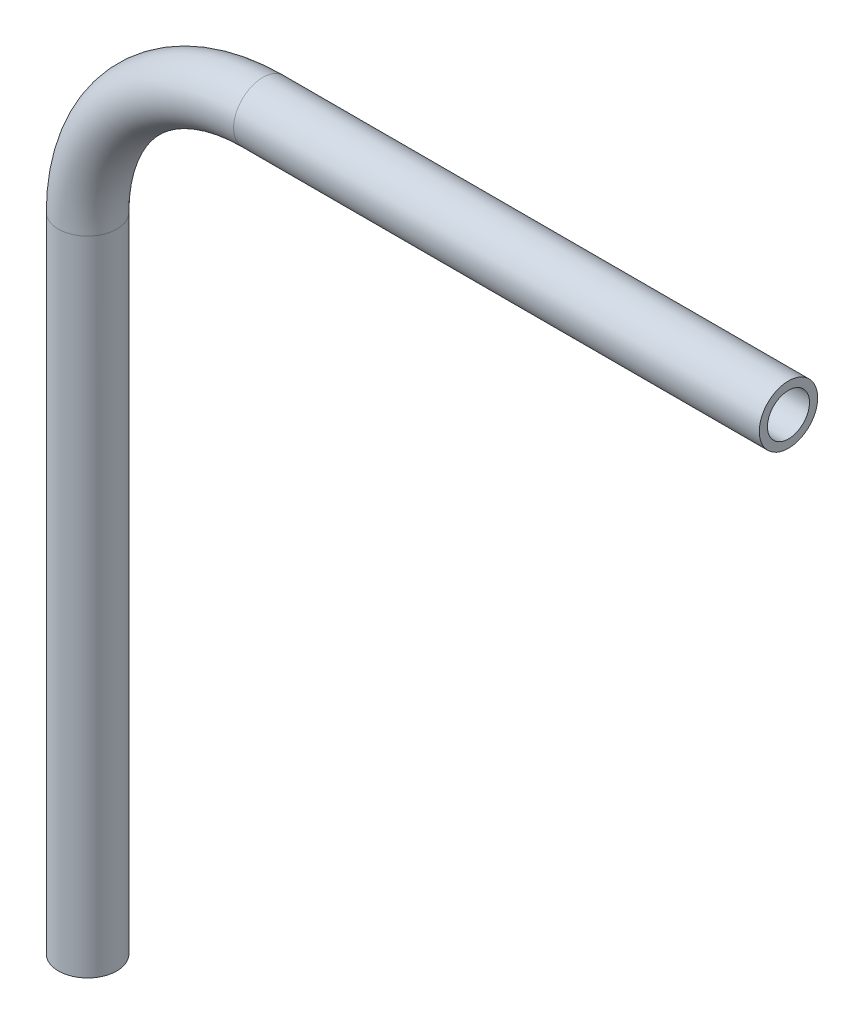
ISO-10303-21;
HEADER;
FILE_DESCRIPTION(('STEP AP214'),'2;1');
FILE_NAME('part.step','',(''),(''),'','','');
FILE_SCHEMA(('AUTOMOTIVE_DESIGN { 1 0 10303 214 1 1 1 1 }'));
ENDSEC;
DATA;
#1=APPLICATION_CONTEXT('core data for automotive mechanical design processes');
#2=APPLICATION_PROTOCOL_DEFINITION('international standard','automotive_design',2000,#1);
#3=PRODUCT_CONTEXT('',#1,'mechanical');
#4=PRODUCT('Part','Part','',(#3));
#5=PRODUCT_RELATED_PRODUCT_CATEGORY('part','',(#4));
#6=PRODUCT_DEFINITION_FORMATION('','',#4);
#7=PRODUCT_DEFINITION_CONTEXT('part definition',#1,'design');
#8=PRODUCT_DEFINITION('design','',#6,#7);
#9=PRODUCT_DEFINITION_SHAPE('','',#8);
#10=(LENGTH_UNIT() NAMED_UNIT(*) SI_UNIT(.MILLI.,.METRE.));
#11=(NAMED_UNIT(*) PLANE_ANGLE_UNIT() SI_UNIT($,.RADIAN.));
#12=(NAMED_UNIT(*) SI_UNIT($,.STERADIAN.) SOLID_ANGLE_UNIT());
#13=UNCERTAINTY_MEASURE_WITH_UNIT(LENGTH_MEASURE(1.E-05),#10,'distance_accuracy_value','');
#14=(GEOMETRIC_REPRESENTATION_CONTEXT(3) GLOBAL_UNCERTAINTY_ASSIGNED_CONTEXT((#13)) GLOBAL_UNIT_ASSIGNED_CONTEXT((#10,
#11,#12)) REPRESENTATION_CONTEXT('',''));
#15=CARTESIAN_POINT('',(0.,0.,0.));
#16=DIRECTION('',(0.,0.,1.));
#17=DIRECTION('',(1.,0.,0.));
#18=AXIS2_PLACEMENT_3D('',#15,#16,#17);
#19=CARTESIAN_POINT('',(0.,-71.3723178807947,0.));
#20=DIRECTION('',(0.,1.,0.));
#21=DIRECTION('',(0.,0.,1.));
#22=AXIS2_PLACEMENT_3D('',#19,#20,#21);
#23=CYLINDRICAL_SURFACE('',#22,3.175);
#24=CARTESIAN_POINT('',(0.,-1.52231788079483,0.));
#25=DIRECTION('',(0.,1.,0.));
#26=DIRECTION('',(0.,0.,-1.));
#27=AXIS2_PLACEMENT_3D('',#24,#25,#26);
#28=CIRCLE('',#27,3.175);
#29=CARTESIAN_POINT('',(-3.175,-1.52231788079486,0.));
#30=VERTEX_POINT('',#29);
#31=EDGE_CURVE('E78',#30,#30,#28,.T.);
#32=ORIENTED_EDGE('',*,*,#31,.F.);
#33=EDGE_LOOP('',(#32));
#34=FACE_BOUND('',#33,.T.);
#35=CARTESIAN_POINT('',(0.,-71.3723178807947,0.));
#36=DIRECTION('',(0.,1.,0.));
#37=DIRECTION('',(0.,0.,-1.));
#38=AXIS2_PLACEMENT_3D('',#35,#36,#37);
#39=CIRCLE('',#38,3.175);
#40=CARTESIAN_POINT('',(0.,-71.3723178807947,-3.175));
#41=VERTEX_POINT('',#40);
#42=EDGE_CURVE('E47',#41,#41,#39,.T.);
#43=ORIENTED_EDGE('',*,*,#42,.T.);
#44=EDGE_LOOP('',(#43));
#45=FACE_BOUND('',#44,.T.);
#46=ADVANCED_FACE('F32',(#34,#45),#23,.T.);
#47=CARTESIAN_POINT('',(19.05,-1.52231788079469,0.));
#48=DIRECTION('',(0.,0.,-1.));
#49=DIRECTION('',(-1.,0.,0.));
#50=AXIS2_PLACEMENT_3D('',#47,#48,#49);
#51=TOROIDAL_SURFACE('',#50,19.05,3.175);
#52=CARTESIAN_POINT('',(19.05,17.5276821192059,0.));
#53=DIRECTION('',(1.,0.,0.));
#54=DIRECTION('',(0.,0.,-1.));
#55=AXIS2_PLACEMENT_3D('',#52,#53,#54);
#56=CIRCLE('',#55,3.175);
#57=CARTESIAN_POINT('',(19.05,20.7026821192053,0.));
#58=VERTEX_POINT('',#57);
#59=EDGE_CURVE('E36',#58,#58,#56,.T.);
#60=CARTESIAN_POINT('',(19.05,-1.52231788079469,0.));
#61=DIRECTION('',(0.,0.,-1.));
#62=DIRECTION('',(-1.,0.,0.));
#63=AXIS2_PLACEMENT_3D('',#60,#61,#62);
#64=CIRCLE('',#63,22.225);
#65=EDGE_CURVE('',#30,#58,#64,.T.);
#66=ORIENTED_EDGE('',*,*,#31,.T.);
#67=ORIENTED_EDGE('',*,*,#59,.F.);
#68=ORIENTED_EDGE('',*,*,#65,.T.);
#69=ORIENTED_EDGE('',*,*,#65,.F.);
#70=EDGE_LOOP('',(#66,#68,#67,#69));
#71=FACE_BOUND('',#70,.T.);
#72=ADVANCED_FACE('F86',(#71),#51,.T.);
#73=CARTESIAN_POINT('',(19.0500000000001,17.5276821192053,0.));
#74=DIRECTION('',(1.,0.,0.));
#75=DIRECTION('',(0.,1.,0.));
#76=AXIS2_PLACEMENT_3D('',#73,#74,#75);
#77=CYLINDRICAL_SURFACE('',#76,3.175);
#78=CARTESIAN_POINT('',(76.2,17.5276821192053,0.));
#79=DIRECTION('',(1.,0.,0.));
#80=DIRECTION('',(0.,0.,-1.));
#81=AXIS2_PLACEMENT_3D('',#78,#79,#80);
#82=CIRCLE('',#81,3.175);
#83=CARTESIAN_POINT('',(76.2,17.5276821192053,-3.175));
#84=VERTEX_POINT('',#83);
#85=EDGE_CURVE('E52',#84,#84,#82,.T.);
#86=ORIENTED_EDGE('',*,*,#85,.F.);
#87=EDGE_LOOP('',(#86));
#88=FACE_BOUND('',#87,.T.);
#89=ORIENTED_EDGE('',*,*,#59,.T.);
#90=EDGE_LOOP('',(#89));
#91=FACE_BOUND('',#90,.T.);
#92=ADVANCED_FACE('F34',(#88,#91),#77,.T.);
#93=CARTESIAN_POINT('',(0.,-71.3723178807947,0.));
#94=DIRECTION('',(0.,1.,0.));
#95=DIRECTION('',(0.,0.,-1.));
#96=AXIS2_PLACEMENT_3D('',#93,#94,#95);
#97=PLANE('',#96);
#98=CARTESIAN_POINT('',(0.,-71.3723178807947,0.));
#99=DIRECTION('',(0.,1.,0.));
#100=DIRECTION('',(0.,0.,-1.));
#101=AXIS2_PLACEMENT_3D('',#98,#99,#100);
#102=CIRCLE('',#101,2.286);
#103=CARTESIAN_POINT('',(0.,-71.3723178807947,-2.286));
#104=VERTEX_POINT('',#103);
#105=EDGE_CURVE('E73',#104,#104,#102,.F.);
#106=ORIENTED_EDGE('',*,*,#105,.F.);
#107=EDGE_LOOP('',(#106));
#108=FACE_BOUND('',#107,.T.);
#109=ORIENTED_EDGE('',*,*,#42,.F.);
#110=EDGE_LOOP('',(#109));
#111=FACE_BOUND('',#110,.T.);
#112=ADVANCED_FACE('F92',(#108,#111),#97,.F.);
#113=CARTESIAN_POINT('',(76.2,17.5276821192053,0.));
#114=DIRECTION('',(1.,0.,0.));
#115=DIRECTION('',(0.,0.,-1.));
#116=AXIS2_PLACEMENT_3D('',#113,#114,#115);
#117=PLANE('',#116);
#118=CARTESIAN_POINT('',(76.2,17.5276821192053,0.));
#119=DIRECTION('',(1.,0.,0.));
#120=DIRECTION('',(0.,0.,-1.));
#121=AXIS2_PLACEMENT_3D('',#118,#119,#120);
#122=CIRCLE('',#121,2.286);
#123=CARTESIAN_POINT('',(76.2,17.5276821192053,-2.286));
#124=VERTEX_POINT('',#123);
#125=EDGE_CURVE('E11',#124,#124,#122,.F.);
#126=ORIENTED_EDGE('',*,*,#125,.T.);
#127=EDGE_LOOP('',(#126));
#128=FACE_BOUND('',#127,.T.);
#129=ORIENTED_EDGE('',*,*,#85,.T.);
#130=EDGE_LOOP('',(#129));
#131=FACE_BOUND('',#130,.T.);
#132=ADVANCED_FACE('F59',(#128,#131),#117,.T.);
#133=CARTESIAN_POINT('',(0.,-71.3723178807947,0.));
#134=DIRECTION('',(0.,1.,0.));
#135=DIRECTION('',(0.,0.,1.));
#136=AXIS2_PLACEMENT_3D('',#133,#134,#135);
#137=CYLINDRICAL_SURFACE('',#136,2.286);
#138=CARTESIAN_POINT('',(0.,-1.52231788079483,0.));
#139=DIRECTION('',(0.,1.,0.));
#140=DIRECTION('',(0.,0.,-1.));
#141=AXIS2_PLACEMENT_3D('',#138,#139,#140);
#142=CIRCLE('',#141,2.286);
#143=CARTESIAN_POINT('',(-2.286,-1.52231788079485,0.));
#144=VERTEX_POINT('',#143);
#145=EDGE_CURVE('E70',#144,#144,#142,.F.);
#146=ORIENTED_EDGE('',*,*,#145,.F.);
#147=EDGE_LOOP('',(#146));
#148=FACE_BOUND('',#147,.T.);
#149=ORIENTED_EDGE('',*,*,#105,.T.);
#150=EDGE_LOOP('',(#149));
#151=FACE_BOUND('',#150,.T.);
#152=ADVANCED_FACE('F100',(#148,#151),#137,.F.);
#153=CARTESIAN_POINT('',(19.05,-1.52231788079469,0.));
#154=DIRECTION('',(0.,0.,-1.));
#155=DIRECTION('',(-1.,0.,0.));
#156=AXIS2_PLACEMENT_3D('',#153,#154,#155);
#157=TOROIDAL_SURFACE('',#156,19.05,2.286);
#158=CARTESIAN_POINT('',(19.05,17.5276821192059,0.));
#159=DIRECTION('',(1.,0.,0.));
#160=DIRECTION('',(0.,0.,-1.));
#161=AXIS2_PLACEMENT_3D('',#158,#159,#160);
#162=CIRCLE('',#161,2.286);
#163=CARTESIAN_POINT('',(19.05,19.8136821192053,0.));
#164=VERTEX_POINT('',#163);
#165=EDGE_CURVE('E41',#164,#164,#162,.F.);
#166=CARTESIAN_POINT('',(19.05,-1.52231788079469,0.));
#167=DIRECTION('',(0.,0.,-1.));
#168=DIRECTION('',(-1.,0.,0.));
#169=AXIS2_PLACEMENT_3D('',#166,#167,#168);
#170=CIRCLE('',#169,21.336);
#171=EDGE_CURVE('',#144,#164,#170,.T.);
#172=ORIENTED_EDGE('',*,*,#145,.T.);
#173=ORIENTED_EDGE('',*,*,#165,.F.);
#174=ORIENTED_EDGE('',*,*,#171,.T.);
#175=ORIENTED_EDGE('',*,*,#171,.F.);
#176=EDGE_LOOP('',(#172,#174,#173,#175));
#177=FACE_BOUND('',#176,.T.);
#178=ADVANCED_FACE('F65',(#177),#157,.F.);
#179=CARTESIAN_POINT('',(19.0500000000001,17.5276821192053,0.));
#180=DIRECTION('',(1.,0.,0.));
#181=DIRECTION('',(0.,1.,0.));
#182=AXIS2_PLACEMENT_3D('',#179,#180,#181);
#183=CYLINDRICAL_SURFACE('',#182,2.286);
#184=ORIENTED_EDGE('',*,*,#125,.F.);
#185=EDGE_LOOP('',(#184));
#186=FACE_BOUND('',#185,.T.);
#187=ORIENTED_EDGE('',*,*,#165,.T.);
#188=EDGE_LOOP('',(#187));
#189=FACE_BOUND('',#188,.T.);
#190=ADVANCED_FACE('F62',(#186,#189),#183,.F.);
#191=CLOSED_SHELL('',(#46,#72,#92,#112,#132,#152,#178,#190));
#192=MANIFOLD_SOLID_BREP('B2',#191);
#193=ADVANCED_BREP_SHAPE_REPRESENTATION('',(#18,#192),#14);
#194=SHAPE_DEFINITION_REPRESENTATION(#9,#193);
ENDSEC;
END-ISO-10303-21;
